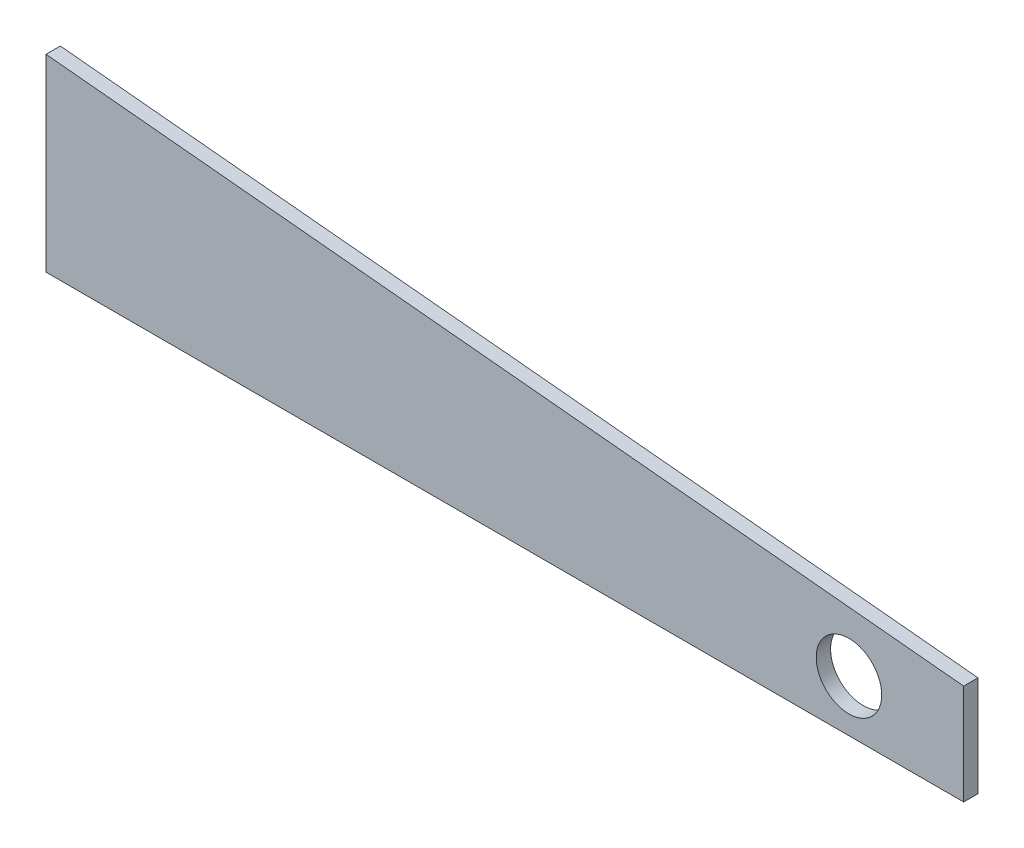
ISO-10303-21;
HEADER;
FILE_DESCRIPTION(('STEP AP214'),'2;1');
FILE_NAME('part.step','',(''),(''),'','','');
FILE_SCHEMA(('AUTOMOTIVE_DESIGN { 1 0 10303 214 1 1 1 1 }'));
ENDSEC;
DATA;
#1=APPLICATION_CONTEXT('core data for automotive mechanical design processes');
#2=APPLICATION_PROTOCOL_DEFINITION('international standard','automotive_design',2000,#1);
#3=PRODUCT_CONTEXT('',#1,'mechanical');
#4=PRODUCT('Part','Part','',(#3));
#5=PRODUCT_RELATED_PRODUCT_CATEGORY('part','',(#4));
#6=PRODUCT_DEFINITION_FORMATION('','',#4);
#7=PRODUCT_DEFINITION_CONTEXT('part definition',#1,'design');
#8=PRODUCT_DEFINITION('design','',#6,#7);
#9=PRODUCT_DEFINITION_SHAPE('','',#8);
#10=(LENGTH_UNIT() NAMED_UNIT(*) SI_UNIT(.MILLI.,.METRE.));
#11=(NAMED_UNIT(*) PLANE_ANGLE_UNIT() SI_UNIT($,.RADIAN.));
#12=(NAMED_UNIT(*) SI_UNIT($,.STERADIAN.) SOLID_ANGLE_UNIT());
#13=UNCERTAINTY_MEASURE_WITH_UNIT(LENGTH_MEASURE(1.E-05),#10,'distance_accuracy_value','');
#14=(GEOMETRIC_REPRESENTATION_CONTEXT(3) GLOBAL_UNCERTAINTY_ASSIGNED_CONTEXT((#13)) GLOBAL_UNIT_ASSIGNED_CONTEXT((#10,
#11,#12)) REPRESENTATION_CONTEXT('',''));
#15=CARTESIAN_POINT('',(0.,0.,0.));
#16=DIRECTION('',(0.,0.,1.));
#17=DIRECTION('',(1.,0.,0.));
#18=AXIS2_PLACEMENT_3D('',#15,#16,#17);
#19=CARTESIAN_POINT('',(406.4,0.,6.35));
#20=DIRECTION('',(-1.,0.,0.));
#21=DIRECTION('',(0.,0.,1.));
#22=AXIS2_PLACEMENT_3D('',#19,#20,#21);
#23=PLANE('',#22);
#24=DIRECTION('',(0.,1.,0.));
#25=VECTOR('',#24,1.);
#26=CARTESIAN_POINT('',(406.4,0.,0.));
#27=LINE('',#26,#25);
#28=CARTESIAN_POINT('',(406.4,0.,0.));
#29=VERTEX_POINT('',#28);
#30=CARTESIAN_POINT('',(406.4,44.45,0.));
#31=VERTEX_POINT('',#30);
#32=EDGE_CURVE('E97',#29,#31,#27,.T.);
#33=ORIENTED_EDGE('',*,*,#32,.T.);
#34=DIRECTION('',(0.,0.,-1.));
#35=VECTOR('',#34,1.);
#36=CARTESIAN_POINT('',(406.4,44.45,6.35));
#37=LINE('',#36,#35);
#38=CARTESIAN_POINT('',(406.4,44.45,6.35));
#39=VERTEX_POINT('',#38);
#40=EDGE_CURVE('E11',#39,#31,#37,.T.);
#41=ORIENTED_EDGE('',*,*,#40,.F.);
#42=DIRECTION('',(0.,1.,0.));
#43=VECTOR('',#42,1.);
#44=CARTESIAN_POINT('',(406.4,0.,6.35));
#45=LINE('',#44,#43);
#46=CARTESIAN_POINT('',(406.4,0.,6.35));
#47=VERTEX_POINT('',#46);
#48=EDGE_CURVE('E85',#47,#39,#45,.T.);
#49=ORIENTED_EDGE('',*,*,#48,.F.);
#50=DIRECTION('',(0.,0.,-1.));
#51=VECTOR('',#50,1.);
#52=CARTESIAN_POINT('',(406.4,0.,6.35));
#53=LINE('',#52,#51);
#54=EDGE_CURVE('E93',#47,#29,#53,.T.);
#55=ORIENTED_EDGE('',*,*,#54,.T.);
#56=EDGE_LOOP('',(#33,#41,#49,#55));
#57=FACE_BOUND('',#56,.T.);
#58=ADVANCED_FACE('F34',(#57),#23,.F.);
#59=CARTESIAN_POINT('',(406.4,44.45,6.35));
#60=DIRECTION('',(-0.0958072409389079,-0.995399905858783,0.));
#61=DIRECTION('',(0.995399905858783,-0.0958072409389079,0.));
#62=AXIS2_PLACEMENT_3D('',#59,#60,#61);
#63=PLANE('',#62);
#64=DIRECTION('',(-0.995399905858783,0.0958072409389079,0.));
#65=VECTOR('',#64,1.);
#66=CARTESIAN_POINT('',(406.4,44.45,0.));
#67=LINE('',#66,#65);
#68=CARTESIAN_POINT('',(0.,83.566,0.));
#69=VERTEX_POINT('',#68);
#70=EDGE_CURVE('E89',#31,#69,#67,.T.);
#71=ORIENTED_EDGE('',*,*,#70,.T.);
#72=DIRECTION('',(0.,0.,-1.));
#73=VECTOR('',#72,1.);
#74=CARTESIAN_POINT('',(0.,83.566,6.35));
#75=LINE('',#74,#73);
#76=CARTESIAN_POINT('',(0.,83.566,6.35));
#77=VERTEX_POINT('',#76);
#78=EDGE_CURVE('E42',#77,#69,#75,.T.);
#79=ORIENTED_EDGE('',*,*,#78,.F.);
#80=DIRECTION('',(-0.995399905858783,0.0958072409389079,0.));
#81=VECTOR('',#80,1.);
#82=CARTESIAN_POINT('',(406.4,44.45,6.35));
#83=LINE('',#82,#81);
#84=EDGE_CURVE('E80',#39,#77,#83,.T.);
#85=ORIENTED_EDGE('',*,*,#84,.F.);
#86=ORIENTED_EDGE('',*,*,#40,.T.);
#87=EDGE_LOOP('',(#71,#79,#85,#86));
#88=FACE_BOUND('',#87,.T.);
#89=ADVANCED_FACE('F88',(#88),#63,.F.);
#90=CARTESIAN_POINT('',(0.,83.566,6.35));
#91=DIRECTION('',(1.,0.,0.));
#92=DIRECTION('',(0.,1.,0.));
#93=AXIS2_PLACEMENT_3D('',#90,#91,#92);
#94=PLANE('',#93);
#95=DIRECTION('',(0.,-1.,0.));
#96=VECTOR('',#95,1.);
#97=CARTESIAN_POINT('',(0.,83.566,0.));
#98=LINE('',#97,#96);
#99=CARTESIAN_POINT('',(0.,0.,0.));
#100=VERTEX_POINT('',#99);
#101=EDGE_CURVE('E67',#69,#100,#98,.T.);
#102=ORIENTED_EDGE('',*,*,#101,.T.);
#103=DIRECTION('',(0.,0.,-1.));
#104=VECTOR('',#103,1.);
#105=CARTESIAN_POINT('',(0.,0.,6.35));
#106=LINE('',#105,#104);
#107=CARTESIAN_POINT('',(0.,0.,6.35));
#108=VERTEX_POINT('',#107);
#109=EDGE_CURVE('E90',#108,#100,#106,.T.);
#110=ORIENTED_EDGE('',*,*,#109,.F.);
#111=DIRECTION('',(0.,-1.,0.));
#112=VECTOR('',#111,1.);
#113=CARTESIAN_POINT('',(0.,83.566,6.35));
#114=LINE('',#113,#112);
#115=EDGE_CURVE('E83',#77,#108,#114,.T.);
#116=ORIENTED_EDGE('',*,*,#115,.F.);
#117=ORIENTED_EDGE('',*,*,#78,.T.);
#118=EDGE_LOOP('',(#102,#110,#116,#117));
#119=FACE_BOUND('',#118,.T.);
#120=ADVANCED_FACE('F91',(#119),#94,.F.);
#121=CARTESIAN_POINT('',(0.,0.,6.35));
#122=DIRECTION('',(0.,1.,0.));
#123=DIRECTION('',(0.,0.,1.));
#124=AXIS2_PLACEMENT_3D('',#121,#122,#123);
#125=PLANE('',#124);
#126=DIRECTION('',(1.,0.,0.));
#127=VECTOR('',#126,1.);
#128=CARTESIAN_POINT('',(0.,0.,0.));
#129=LINE('',#128,#127);
#130=EDGE_CURVE('E73',#100,#29,#129,.T.);
#131=ORIENTED_EDGE('',*,*,#130,.T.);
#132=ORIENTED_EDGE('',*,*,#54,.F.);
#133=DIRECTION('',(1.,0.,0.));
#134=VECTOR('',#133,1.);
#135=CARTESIAN_POINT('',(0.,0.,6.35));
#136=LINE('',#135,#134);
#137=EDGE_CURVE('E50',#108,#47,#136,.T.);
#138=ORIENTED_EDGE('',*,*,#137,.F.);
#139=ORIENTED_EDGE('',*,*,#109,.T.);
#140=EDGE_LOOP('',(#131,#132,#138,#139));
#141=FACE_BOUND('',#140,.T.);
#142=ADVANCED_FACE('F105',(#141),#125,.F.);
#143=CARTESIAN_POINT('',(0.,0.,6.35));
#144=DIRECTION('',(0.,0.,-1.));
#145=DIRECTION('',(-1.,0.,0.));
#146=AXIS2_PLACEMENT_3D('',#143,#144,#145);
#147=PLANE('',#146);
#148=CARTESIAN_POINT('',(355.6,22.86,6.35));
#149=DIRECTION('',(0.,0.,1.));
#150=DIRECTION('',(1.,0.,0.));
#151=AXIS2_PLACEMENT_3D('',#148,#149,#150);
#152=CIRCLE('',#151,14.499971);
#153=CARTESIAN_POINT('',(370.099971,22.86,6.35));
#154=VERTEX_POINT('',#153);
#155=EDGE_CURVE('E111',#154,#154,#152,.T.);
#156=ORIENTED_EDGE('',*,*,#155,.F.);
#157=EDGE_LOOP('',(#156));
#158=FACE_BOUND('',#157,.T.);
#159=ORIENTED_EDGE('',*,*,#48,.T.);
#160=ORIENTED_EDGE('',*,*,#84,.T.);
#161=ORIENTED_EDGE('',*,*,#115,.T.);
#162=ORIENTED_EDGE('',*,*,#137,.T.);
#163=EDGE_LOOP('',(#159,#160,#161,#162));
#164=FACE_BOUND('',#163,.T.);
#165=ADVANCED_FACE('F81',(#158,#164),#147,.F.);
#166=CARTESIAN_POINT('',(0.,0.,0.));
#167=DIRECTION('',(0.,0.,-1.));
#168=DIRECTION('',(-1.,0.,0.));
#169=AXIS2_PLACEMENT_3D('',#166,#167,#168);
#170=PLANE('',#169);
#171=CARTESIAN_POINT('',(355.6,22.86,0.));
#172=DIRECTION('',(0.,0.,1.));
#173=DIRECTION('',(1.,0.,0.));
#174=AXIS2_PLACEMENT_3D('',#171,#172,#173);
#175=CIRCLE('',#174,14.499971);
#176=CARTESIAN_POINT('',(370.099971,22.86,0.));
#177=VERTEX_POINT('',#176);
#178=EDGE_CURVE('E100',#177,#177,#175,.T.);
#179=ORIENTED_EDGE('',*,*,#178,.T.);
#180=EDGE_LOOP('',(#179));
#181=FACE_BOUND('',#180,.T.);
#182=ORIENTED_EDGE('',*,*,#32,.F.);
#183=ORIENTED_EDGE('',*,*,#130,.F.);
#184=ORIENTED_EDGE('',*,*,#101,.F.);
#185=ORIENTED_EDGE('',*,*,#70,.F.);
#186=EDGE_LOOP('',(#182,#183,#184,#185));
#187=FACE_BOUND('',#186,.T.);
#188=ADVANCED_FACE('F108',(#181,#187),#170,.T.);
#189=CARTESIAN_POINT('',(355.6,22.86,0.));
#190=DIRECTION('',(0.,0.,1.));
#191=DIRECTION('',(1.,0.,0.));
#192=AXIS2_PLACEMENT_3D('',#189,#190,#191);
#193=CYLINDRICAL_SURFACE('',#192,14.499971);
#194=ORIENTED_EDGE('',*,*,#178,.F.);
#195=EDGE_LOOP('',(#194));
#196=FACE_BOUND('',#195,.T.);
#197=ORIENTED_EDGE('',*,*,#155,.T.);
#198=EDGE_LOOP('',(#197));
#199=FACE_BOUND('',#198,.T.);
#200=ADVANCED_FACE('F118',(#196,#199),#193,.F.);
#201=CLOSED_SHELL('',(#58,#89,#120,#142,#165,#188,#200));
#202=MANIFOLD_SOLID_BREP('B2',#201);
#203=ADVANCED_BREP_SHAPE_REPRESENTATION('',(#18,#202),#14);
#204=SHAPE_DEFINITION_REPRESENTATION(#9,#203);
ENDSEC;
END-ISO-10303-21;
